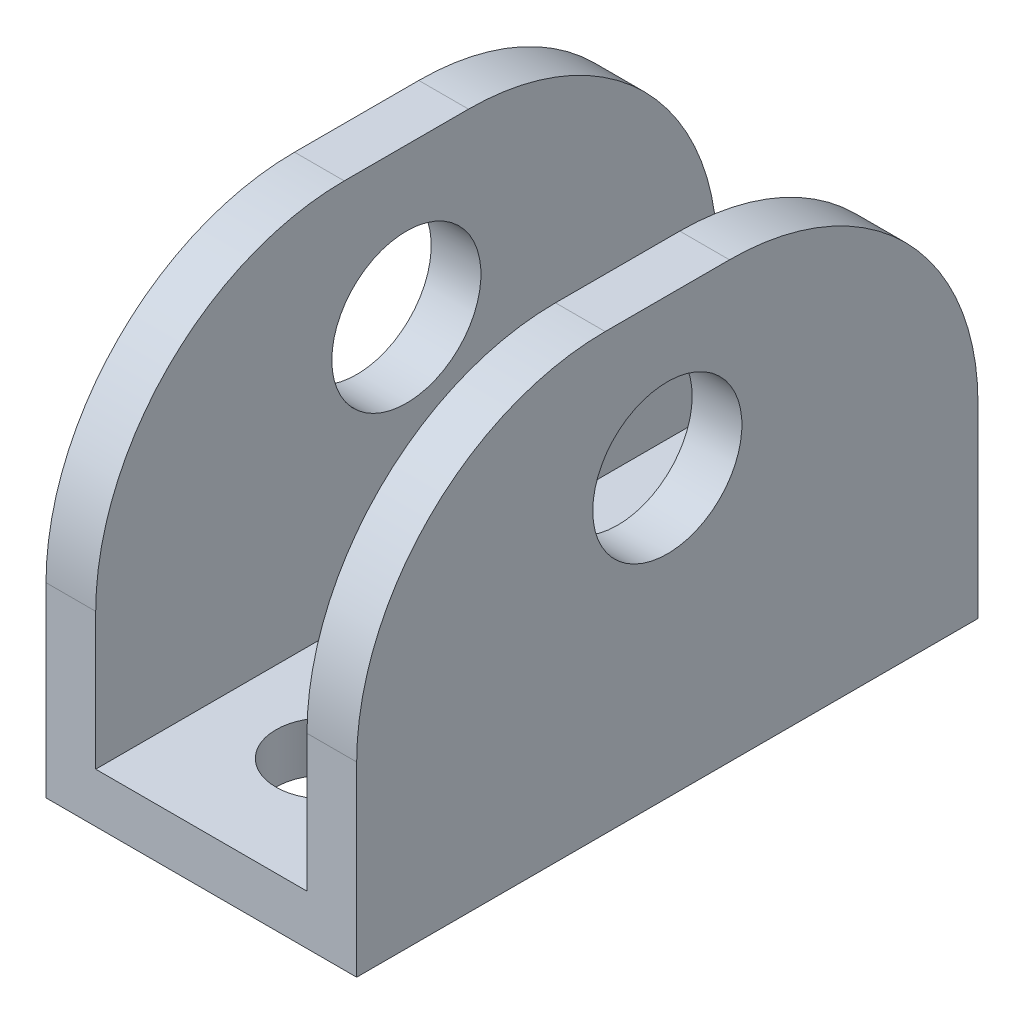
ISO-10303-21;
HEADER;
FILE_DESCRIPTION(('STEP AP214'),'2;1');
FILE_NAME('part.step','',(''),(''),'','','');
FILE_SCHEMA(('AUTOMOTIVE_DESIGN { 1 0 10303 214 1 1 1 1 }'));
ENDSEC;
DATA;
#1=APPLICATION_CONTEXT('core data for automotive mechanical design processes');
#2=APPLICATION_PROTOCOL_DEFINITION('international standard','automotive_design',2000,#1);
#3=PRODUCT_CONTEXT('',#1,'mechanical');
#4=PRODUCT('Part','Part','',(#3));
#5=PRODUCT_RELATED_PRODUCT_CATEGORY('part','',(#4));
#6=PRODUCT_DEFINITION_FORMATION('','',#4);
#7=PRODUCT_DEFINITION_CONTEXT('part definition',#1,'design');
#8=PRODUCT_DEFINITION('design','',#6,#7);
#9=PRODUCT_DEFINITION_SHAPE('','',#8);
#10=(LENGTH_UNIT() NAMED_UNIT(*) SI_UNIT(.MILLI.,.METRE.));
#11=(NAMED_UNIT(*) PLANE_ANGLE_UNIT() SI_UNIT($,.RADIAN.));
#12=(NAMED_UNIT(*) SI_UNIT($,.STERADIAN.) SOLID_ANGLE_UNIT());
#13=UNCERTAINTY_MEASURE_WITH_UNIT(LENGTH_MEASURE(1.E-05),#10,'distance_accuracy_value','');
#14=(GEOMETRIC_REPRESENTATION_CONTEXT(3) GLOBAL_UNCERTAINTY_ASSIGNED_CONTEXT((#13)) GLOBAL_UNIT_ASSIGNED_CONTEXT((#10,
#11,#12)) REPRESENTATION_CONTEXT('',''));
#15=CARTESIAN_POINT('',(0.,0.,0.));
#16=DIRECTION('',(0.,0.,1.));
#17=DIRECTION('',(1.,0.,0.));
#18=AXIS2_PLACEMENT_3D('',#15,#16,#17);
#19=CARTESIAN_POINT('',(25.,17.5,25.));
#20=DIRECTION('',(0.,-1.,0.));
#21=DIRECTION('',(0.,0.,-1.));
#22=AXIS2_PLACEMENT_3D('',#19,#20,#21);
#23=PLANE('',#22);
#24=DIRECTION('',(0.,0.,1.));
#25=VECTOR('',#24,1.);
#26=CARTESIAN_POINT('',(0.,17.5,25.));
#27=LINE('',#26,#25);
#28=CARTESIAN_POINT('',(0.,17.5,-5.));
#29=VERTEX_POINT('',#28);
#30=CARTESIAN_POINT('',(0.,17.5,5.));
#31=VERTEX_POINT('',#30);
#32=EDGE_CURVE('E184',#29,#31,#27,.T.);
#33=ORIENTED_EDGE('',*,*,#32,.T.);
#34=DIRECTION('',(-1.,0.,0.));
#35=VECTOR('',#34,1.);
#36=CARTESIAN_POINT('',(25.,17.5,5.));
#37=LINE('',#36,#35);
#38=CARTESIAN_POINT('',(4.,17.5,5.));
#39=VERTEX_POINT('',#38);
#40=EDGE_CURVE('E61',#31,#39,#37,.F.);
#41=ORIENTED_EDGE('',*,*,#40,.T.);
#42=DIRECTION('',(0.,0.,1.));
#43=VECTOR('',#42,1.);
#44=CARTESIAN_POINT('',(4.,17.5,-25.));
#45=LINE('',#44,#43);
#46=CARTESIAN_POINT('',(4.,17.5,-5.));
#47=VERTEX_POINT('',#46);
#48=EDGE_CURVE('E229',#47,#39,#45,.T.);
#49=ORIENTED_EDGE('',*,*,#48,.F.);
#50=DIRECTION('',(-1.,0.,0.));
#51=VECTOR('',#50,1.);
#52=CARTESIAN_POINT('',(25.,17.5,-5.));
#53=LINE('',#52,#51);
#54=EDGE_CURVE('E224',#47,#29,#53,.T.);
#55=ORIENTED_EDGE('',*,*,#54,.T.);
#56=EDGE_LOOP('',(#33,#41,#49,#55));
#57=FACE_BOUND('',#56,.T.);
#58=ADVANCED_FACE('F46',(#57),#23,.F.);
#59=CARTESIAN_POINT('',(25.,17.5,-25.));
#60=DIRECTION('',(0.,0.,1.));
#61=DIRECTION('',(0.,-1.,0.));
#62=AXIS2_PLACEMENT_3D('',#59,#60,#61);
#63=PLANE('',#62);
#64=DIRECTION('',(0.,1.,0.));
#65=VECTOR('',#64,1.);
#66=CARTESIAN_POINT('',(21.,-70.3109837060436,-25.));
#67=LINE('',#66,#65);
#68=CARTESIAN_POINT('',(21.,-13.5,-25.));
#69=VERTEX_POINT('',#68);
#70=CARTESIAN_POINT('',(21.,-2.49999999999999,-25.));
#71=VERTEX_POINT('',#70);
#72=EDGE_CURVE('E142',#69,#71,#67,.T.);
#73=ORIENTED_EDGE('',*,*,#72,.T.);
#74=DIRECTION('',(-1.,0.,0.));
#75=VECTOR('',#74,1.);
#76=CARTESIAN_POINT('',(25.,-2.5,-25.));
#77=LINE('',#76,#75);
#78=CARTESIAN_POINT('',(25.,-2.5,-25.));
#79=VERTEX_POINT('',#78);
#80=EDGE_CURVE('E210',#71,#79,#77,.F.);
#81=ORIENTED_EDGE('',*,*,#80,.T.);
#82=DIRECTION('',(0.,1.,0.));
#83=VECTOR('',#82,1.);
#84=CARTESIAN_POINT('',(25.,17.5,-25.));
#85=LINE('',#84,#83);
#86=CARTESIAN_POINT('',(25.,-17.5,-25.));
#87=VERTEX_POINT('',#86);
#88=EDGE_CURVE('E170',#87,#79,#85,.T.);
#89=ORIENTED_EDGE('',*,*,#88,.F.);
#90=DIRECTION('',(-1.,0.,0.));
#91=VECTOR('',#90,1.);
#92=CARTESIAN_POINT('',(25.,-17.5,-25.));
#93=LINE('',#92,#91);
#94=CARTESIAN_POINT('',(0.,-17.5,-25.));
#95=VERTEX_POINT('',#94);
#96=EDGE_CURVE('E181',#87,#95,#93,.T.);
#97=ORIENTED_EDGE('',*,*,#96,.T.);
#98=DIRECTION('',(0.,1.,0.));
#99=VECTOR('',#98,1.);
#100=CARTESIAN_POINT('',(0.,17.5,-25.));
#101=LINE('',#100,#99);
#102=CARTESIAN_POINT('',(0.,-2.5,-25.));
#103=VERTEX_POINT('',#102);
#104=EDGE_CURVE('E156',#95,#103,#101,.T.);
#105=ORIENTED_EDGE('',*,*,#104,.T.);
#106=DIRECTION('',(-1.,0.,0.));
#107=VECTOR('',#106,1.);
#108=CARTESIAN_POINT('',(25.,-2.5,-25.));
#109=LINE('',#108,#107);
#110=CARTESIAN_POINT('',(4.,-2.49999999999999,-25.));
#111=VERTEX_POINT('',#110);
#112=EDGE_CURVE('E208',#103,#111,#109,.F.);
#113=ORIENTED_EDGE('',*,*,#112,.T.);
#114=DIRECTION('',(0.,1.,0.));
#115=VECTOR('',#114,1.);
#116=CARTESIAN_POINT('',(4.,-70.3109837060436,-25.));
#117=LINE('',#116,#115);
#118=CARTESIAN_POINT('',(4.,-13.5,-25.));
#119=VERTEX_POINT('',#118);
#120=EDGE_CURVE('E147',#119,#111,#117,.T.);
#121=ORIENTED_EDGE('',*,*,#120,.F.);
#122=DIRECTION('',(1.,0.,0.));
#123=VECTOR('',#122,1.);
#124=CARTESIAN_POINT('',(4.,-13.5,-25.));
#125=LINE('',#124,#123);
#126=EDGE_CURVE('E146',#119,#69,#125,.T.);
#127=ORIENTED_EDGE('',*,*,#126,.T.);
#128=EDGE_LOOP('',(#73,#81,#89,#97,#105,#113,#121,#127));
#129=FACE_BOUND('',#128,.T.);
#130=ADVANCED_FACE('F251',(#129),#63,.F.);
#131=DIRECTION('',(0.,0.,1.));
#132=VECTOR('',#131,1.);
#133=CARTESIAN_POINT('',(25.,17.5,25.));
#134=LINE('',#133,#132);
#135=CARTESIAN_POINT('',(25.,17.5,-5.));
#136=VERTEX_POINT('',#135);
#137=CARTESIAN_POINT('',(25.,17.5,5.));
#138=VERTEX_POINT('',#137);
#139=EDGE_CURVE('E173',#136,#138,#134,.T.);
#140=ORIENTED_EDGE('',*,*,#139,.F.);
#141=DIRECTION('',(-1.,0.,0.));
#142=VECTOR('',#141,1.);
#143=CARTESIAN_POINT('',(25.,17.5,-5.));
#144=LINE('',#143,#142);
#145=CARTESIAN_POINT('',(21.,17.5,-5.));
#146=VERTEX_POINT('',#145);
#147=EDGE_CURVE('E201',#136,#146,#144,.T.);
#148=ORIENTED_EDGE('',*,*,#147,.T.);
#149=DIRECTION('',(0.,0.,-1.));
#150=VECTOR('',#149,1.);
#151=CARTESIAN_POINT('',(21.,17.5,-25.));
#152=LINE('',#151,#150);
#153=CARTESIAN_POINT('',(21.,17.5,5.));
#154=VERTEX_POINT('',#153);
#155=EDGE_CURVE('E166',#154,#146,#152,.T.);
#156=ORIENTED_EDGE('',*,*,#155,.F.);
#157=DIRECTION('',(-1.,0.,0.));
#158=VECTOR('',#157,1.);
#159=CARTESIAN_POINT('',(25.,17.5,5.));
#160=LINE('',#159,#158);
#161=EDGE_CURVE('E194',#154,#138,#160,.F.);
#162=ORIENTED_EDGE('',*,*,#161,.T.);
#163=EDGE_LOOP('',(#140,#148,#156,#162));
#164=FACE_BOUND('',#163,.T.);
#165=ADVANCED_FACE('F265',(#164),#23,.F.);
#166=CARTESIAN_POINT('',(25.,17.5,25.));
#167=DIRECTION('',(0.,0.,-1.));
#168=DIRECTION('',(0.,1.,0.));
#169=AXIS2_PLACEMENT_3D('',#166,#167,#168);
#170=PLANE('',#169);
#171=DIRECTION('',(0.,-1.,0.));
#172=VECTOR('',#171,1.);
#173=CARTESIAN_POINT('',(25.,17.5,25.));
#174=LINE('',#173,#172);
#175=CARTESIAN_POINT('',(25.,-2.5,25.));
#176=VERTEX_POINT('',#175);
#177=CARTESIAN_POINT('',(25.,-17.5,25.));
#178=VERTEX_POINT('',#177);
#179=EDGE_CURVE('E177',#176,#178,#174,.T.);
#180=ORIENTED_EDGE('',*,*,#179,.F.);
#181=DIRECTION('',(-1.,0.,0.));
#182=VECTOR('',#181,1.);
#183=CARTESIAN_POINT('',(25.,-2.5,25.));
#184=LINE('',#183,#182);
#185=CARTESIAN_POINT('',(21.,-2.5,25.));
#186=VERTEX_POINT('',#185);
#187=EDGE_CURVE('E162',#176,#186,#184,.T.);
#188=ORIENTED_EDGE('',*,*,#187,.T.);
#189=DIRECTION('',(0.,1.,0.));
#190=VECTOR('',#189,1.);
#191=CARTESIAN_POINT('',(21.,-70.3109837060436,25.));
#192=LINE('',#191,#190);
#193=CARTESIAN_POINT('',(21.,-13.5,25.));
#194=VERTEX_POINT('',#193);
#195=EDGE_CURVE('E140',#194,#186,#192,.T.);
#196=ORIENTED_EDGE('',*,*,#195,.F.);
#197=DIRECTION('',(-1.,0.,0.));
#198=VECTOR('',#197,1.);
#199=CARTESIAN_POINT('',(4.00000000000001,-13.5,25.));
#200=LINE('',#199,#198);
#201=CARTESIAN_POINT('',(4.,-13.5,25.));
#202=VERTEX_POINT('',#201);
#203=EDGE_CURVE('E151',#194,#202,#200,.T.);
#204=ORIENTED_EDGE('',*,*,#203,.T.);
#205=DIRECTION('',(0.,1.,0.));
#206=VECTOR('',#205,1.);
#207=CARTESIAN_POINT('',(4.00000000000001,-70.3109837060436,25.));
#208=LINE('',#207,#206);
#209=CARTESIAN_POINT('',(4.00000000000001,-2.5,25.));
#210=VERTEX_POINT('',#209);
#211=EDGE_CURVE('E163',#202,#210,#208,.T.);
#212=ORIENTED_EDGE('',*,*,#211,.T.);
#213=DIRECTION('',(-1.,0.,0.));
#214=VECTOR('',#213,1.);
#215=CARTESIAN_POINT('',(25.,-2.5,25.));
#216=LINE('',#215,#214);
#217=CARTESIAN_POINT('',(0.,-2.5,25.));
#218=VERTEX_POINT('',#217);
#219=EDGE_CURVE('E216',#210,#218,#216,.T.);
#220=ORIENTED_EDGE('',*,*,#219,.T.);
#221=DIRECTION('',(0.,-1.,0.));
#222=VECTOR('',#221,1.);
#223=CARTESIAN_POINT('',(0.,17.5,25.));
#224=LINE('',#223,#222);
#225=CARTESIAN_POINT('',(0.,-17.5,25.));
#226=VERTEX_POINT('',#225);
#227=EDGE_CURVE('E186',#218,#226,#224,.T.);
#228=ORIENTED_EDGE('',*,*,#227,.T.);
#229=DIRECTION('',(-1.,0.,0.));
#230=VECTOR('',#229,1.);
#231=CARTESIAN_POINT('',(25.,-17.5,25.));
#232=LINE('',#231,#230);
#233=EDGE_CURVE('E191',#178,#226,#232,.T.);
#234=ORIENTED_EDGE('',*,*,#233,.F.);
#235=EDGE_LOOP('',(#180,#188,#196,#204,#212,#220,#228,#234));
#236=FACE_BOUND('',#235,.T.);
#237=ADVANCED_FACE('F160',(#236),#170,.F.);
#238=CARTESIAN_POINT('',(25.,-17.5,25.));
#239=DIRECTION('',(0.,1.,0.));
#240=DIRECTION('',(0.,0.,1.));
#241=AXIS2_PLACEMENT_3D('',#238,#239,#240);
#242=PLANE('',#241);
#243=CARTESIAN_POINT('',(12.5,-17.5,-15.));
#244=DIRECTION('',(0.,-1.,0.));
#245=DIRECTION('',(0.,0.,-1.));
#246=AXIS2_PLACEMENT_3D('',#243,#244,#245);
#247=CIRCLE('',#246,4.);
#248=CARTESIAN_POINT('',(12.5,-17.5,-19.));
#249=VERTEX_POINT('',#248);
#250=EDGE_CURVE('E286',#249,#249,#247,.T.);
#251=ORIENTED_EDGE('',*,*,#250,.F.);
#252=EDGE_LOOP('',(#251));
#253=FACE_BOUND('',#252,.T.);
#254=CARTESIAN_POINT('',(12.5,-17.5,15.));
#255=DIRECTION('',(0.,-1.,0.));
#256=DIRECTION('',(0.,0.,-1.));
#257=AXIS2_PLACEMENT_3D('',#254,#255,#256);
#258=CIRCLE('',#257,4.);
#259=CARTESIAN_POINT('',(12.5,-17.5,11.));
#260=VERTEX_POINT('',#259);
#261=EDGE_CURVE('E280',#260,#260,#258,.T.);
#262=ORIENTED_EDGE('',*,*,#261,.F.);
#263=EDGE_LOOP('',(#262));
#264=FACE_BOUND('',#263,.T.);
#265=DIRECTION('',(0.,0.,-1.));
#266=VECTOR('',#265,1.);
#267=CARTESIAN_POINT('',(0.,-17.5,25.));
#268=LINE('',#267,#266);
#269=EDGE_CURVE('E174',#226,#95,#268,.T.);
#270=ORIENTED_EDGE('',*,*,#269,.T.);
#271=ORIENTED_EDGE('',*,*,#96,.F.);
#272=DIRECTION('',(0.,0.,-1.));
#273=VECTOR('',#272,1.);
#274=CARTESIAN_POINT('',(25.,-17.5,25.));
#275=LINE('',#274,#273);
#276=EDGE_CURVE('E179',#178,#87,#275,.T.);
#277=ORIENTED_EDGE('',*,*,#276,.F.);
#278=ORIENTED_EDGE('',*,*,#233,.T.);
#279=EDGE_LOOP('',(#270,#271,#277,#278));
#280=FACE_BOUND('',#279,.T.);
#281=ADVANCED_FACE('F255',(#253,#264,#280),#242,.F.);
#282=CARTESIAN_POINT('',(25.,0.,0.));
#283=DIRECTION('',(1.,0.,0.));
#284=DIRECTION('',(0.,0.,-1.));
#285=AXIS2_PLACEMENT_3D('',#282,#283,#284);
#286=PLANE('',#285);
#287=CARTESIAN_POINT('',(25.,5.5,0.));
#288=DIRECTION('',(-1.,0.,0.));
#289=DIRECTION('',(0.,0.,1.));
#290=AXIS2_PLACEMENT_3D('',#287,#288,#289);
#291=CIRCLE('',#290,6.);
#292=CARTESIAN_POINT('',(25.,5.5,6.));
#293=VERTEX_POINT('',#292);
#294=EDGE_CURVE('E199',#293,#293,#291,.T.);
#295=ORIENTED_EDGE('',*,*,#294,.T.);
#296=EDGE_LOOP('',(#295));
#297=FACE_BOUND('',#296,.T.);
#298=ORIENTED_EDGE('',*,*,#88,.T.);
#299=CARTESIAN_POINT('',(25.,-2.5,-5.));
#300=DIRECTION('',(1.,0.,0.));
#301=DIRECTION('',(0.,0.,-1.));
#302=AXIS2_PLACEMENT_3D('',#299,#300,#301);
#303=CIRCLE('',#302,20.);
#304=EDGE_CURVE('E214',#79,#136,#303,.T.);
#305=ORIENTED_EDGE('',*,*,#304,.T.);
#306=ORIENTED_EDGE('',*,*,#139,.T.);
#307=CARTESIAN_POINT('',(25.,-2.5,5.));
#308=DIRECTION('',(1.,0.,0.));
#309=DIRECTION('',(0.,0.,-1.));
#310=AXIS2_PLACEMENT_3D('',#307,#308,#309);
#311=CIRCLE('',#310,20.);
#312=EDGE_CURVE('E212',#138,#176,#311,.T.);
#313=ORIENTED_EDGE('',*,*,#312,.T.);
#314=ORIENTED_EDGE('',*,*,#179,.T.);
#315=ORIENTED_EDGE('',*,*,#276,.T.);
#316=EDGE_LOOP('',(#298,#305,#306,#313,#314,#315));
#317=FACE_BOUND('',#316,.T.);
#318=ADVANCED_FACE('F295',(#297,#317),#286,.T.);
#319=CARTESIAN_POINT('',(0.,0.,0.));
#320=DIRECTION('',(1.,0.,0.));
#321=DIRECTION('',(0.,0.,-1.));
#322=AXIS2_PLACEMENT_3D('',#319,#320,#321);
#323=PLANE('',#322);
#324=CARTESIAN_POINT('',(0.,5.5,0.));
#325=DIRECTION('',(-1.,0.,0.));
#326=DIRECTION('',(0.,0.,1.));
#327=AXIS2_PLACEMENT_3D('',#324,#325,#326);
#328=CIRCLE('',#327,6.);
#329=CARTESIAN_POINT('',(0.,5.5,6.));
#330=VERTEX_POINT('',#329);
#331=EDGE_CURVE('E272',#330,#330,#328,.T.);
#332=ORIENTED_EDGE('',*,*,#331,.F.);
#333=EDGE_LOOP('',(#332));
#334=FACE_BOUND('',#333,.T.);
#335=ORIENTED_EDGE('',*,*,#227,.F.);
#336=CARTESIAN_POINT('',(0.,-2.5,5.));
#337=DIRECTION('',(1.,0.,0.));
#338=DIRECTION('',(0.,0.,-1.));
#339=AXIS2_PLACEMENT_3D('',#336,#337,#338);
#340=CIRCLE('',#339,20.);
#341=EDGE_CURVE('E222',#218,#31,#340,.F.);
#342=ORIENTED_EDGE('',*,*,#341,.T.);
#343=ORIENTED_EDGE('',*,*,#32,.F.);
#344=CARTESIAN_POINT('',(0.,-2.5,-5.));
#345=DIRECTION('',(1.,0.,0.));
#346=DIRECTION('',(0.,0.,-1.));
#347=AXIS2_PLACEMENT_3D('',#344,#345,#346);
#348=CIRCLE('',#347,20.);
#349=EDGE_CURVE('E220',#29,#103,#348,.F.);
#350=ORIENTED_EDGE('',*,*,#349,.T.);
#351=ORIENTED_EDGE('',*,*,#104,.F.);
#352=ORIENTED_EDGE('',*,*,#269,.F.);
#353=EDGE_LOOP('',(#335,#342,#343,#350,#351,#352));
#354=FACE_BOUND('',#353,.T.);
#355=ADVANCED_FACE('F233',(#334,#354),#323,.F.);
#356=CARTESIAN_POINT('',(4.,-70.3109837060436,-25.));
#357=DIRECTION('',(-1.,0.,0.));
#358=DIRECTION('',(0.,0.,1.));
#359=AXIS2_PLACEMENT_3D('',#356,#357,#358);
#360=PLANE('',#359);
#361=CARTESIAN_POINT('',(4.,5.5,0.));
#362=DIRECTION('',(-1.,0.,0.));
#363=DIRECTION('',(0.,0.,1.));
#364=AXIS2_PLACEMENT_3D('',#361,#362,#363);
#365=CIRCLE('',#364,6.);
#366=CARTESIAN_POINT('',(4.,5.5,6.));
#367=VERTEX_POINT('',#366);
#368=EDGE_CURVE('E198',#367,#367,#365,.T.);
#369=ORIENTED_EDGE('',*,*,#368,.T.);
#370=EDGE_LOOP('',(#369));
#371=FACE_BOUND('',#370,.T.);
#372=ORIENTED_EDGE('',*,*,#48,.T.);
#373=CARTESIAN_POINT('',(4.,-2.5,5.));
#374=DIRECTION('',(-1.,0.,0.));
#375=DIRECTION('',(0.,0.,1.));
#376=AXIS2_PLACEMENT_3D('',#373,#374,#375);
#377=CIRCLE('',#376,20.);
#378=EDGE_CURVE('E14',#39,#210,#377,.F.);
#379=ORIENTED_EDGE('',*,*,#378,.T.);
#380=ORIENTED_EDGE('',*,*,#211,.F.);
#381=DIRECTION('',(0.,0.,-1.));
#382=VECTOR('',#381,1.);
#383=CARTESIAN_POINT('',(4.,-13.5,-25.));
#384=LINE('',#383,#382);
#385=EDGE_CURVE('E153',#202,#119,#384,.T.);
#386=ORIENTED_EDGE('',*,*,#385,.T.);
#387=ORIENTED_EDGE('',*,*,#120,.T.);
#388=CARTESIAN_POINT('',(4.,-2.5,-5.));
#389=DIRECTION('',(-1.,0.,0.));
#390=DIRECTION('',(0.,0.,1.));
#391=AXIS2_PLACEMENT_3D('',#388,#389,#390);
#392=CIRCLE('',#391,20.);
#393=EDGE_CURVE('E54',#111,#47,#392,.F.);
#394=ORIENTED_EDGE('',*,*,#393,.T.);
#395=EDGE_LOOP('',(#372,#379,#380,#386,#387,#394));
#396=FACE_BOUND('',#395,.T.);
#397=ADVANCED_FACE('F241',(#371,#396),#360,.F.);
#398=CARTESIAN_POINT('',(21.,-70.3109837060436,-25.));
#399=DIRECTION('',(1.,0.,0.));
#400=DIRECTION('',(0.,0.,-1.));
#401=AXIS2_PLACEMENT_3D('',#398,#399,#400);
#402=PLANE('',#401);
#403=CARTESIAN_POINT('',(21.,5.5,0.));
#404=DIRECTION('',(1.,0.,0.));
#405=DIRECTION('',(0.,0.,-1.));
#406=AXIS2_PLACEMENT_3D('',#403,#404,#405);
#407=CIRCLE('',#406,6.);
#408=CARTESIAN_POINT('',(21.,5.5,-6.));
#409=VERTEX_POINT('',#408);
#410=EDGE_CURVE('E195',#409,#409,#407,.T.);
#411=ORIENTED_EDGE('',*,*,#410,.T.);
#412=EDGE_LOOP('',(#411));
#413=FACE_BOUND('',#412,.T.);
#414=ORIENTED_EDGE('',*,*,#155,.T.);
#415=CARTESIAN_POINT('',(21.,-2.5,-5.));
#416=DIRECTION('',(1.,0.,0.));
#417=DIRECTION('',(0.,0.,-1.));
#418=AXIS2_PLACEMENT_3D('',#415,#416,#417);
#419=CIRCLE('',#418,20.);
#420=EDGE_CURVE('E206',#146,#71,#419,.F.);
#421=ORIENTED_EDGE('',*,*,#420,.T.);
#422=ORIENTED_EDGE('',*,*,#72,.F.);
#423=DIRECTION('',(0.,0.,1.));
#424=VECTOR('',#423,1.);
#425=CARTESIAN_POINT('',(21.,-13.5,-25.));
#426=LINE('',#425,#424);
#427=EDGE_CURVE('E135',#69,#194,#426,.T.);
#428=ORIENTED_EDGE('',*,*,#427,.T.);
#429=ORIENTED_EDGE('',*,*,#195,.T.);
#430=CARTESIAN_POINT('',(21.,-2.5,5.));
#431=DIRECTION('',(1.,0.,0.));
#432=DIRECTION('',(0.,0.,-1.));
#433=AXIS2_PLACEMENT_3D('',#430,#431,#432);
#434=CIRCLE('',#433,20.);
#435=EDGE_CURVE('E204',#186,#154,#434,.F.);
#436=ORIENTED_EDGE('',*,*,#435,.T.);
#437=EDGE_LOOP('',(#414,#421,#422,#428,#429,#436));
#438=FACE_BOUND('',#437,.T.);
#439=ADVANCED_FACE('F138',(#413,#438),#402,.F.);
#440=CARTESIAN_POINT('',(25.,-13.5,25.));
#441=DIRECTION('',(0.,1.,0.));
#442=DIRECTION('',(0.,0.,1.));
#443=AXIS2_PLACEMENT_3D('',#440,#441,#442);
#444=PLANE('',#443);
#445=CARTESIAN_POINT('',(12.5,-13.5,-15.));
#446=DIRECTION('',(0.,1.,0.));
#447=DIRECTION('',(0.,0.,1.));
#448=AXIS2_PLACEMENT_3D('',#445,#446,#447);
#449=CIRCLE('',#448,4.);
#450=CARTESIAN_POINT('',(12.5,-13.5,-11.));
#451=VERTEX_POINT('',#450);
#452=EDGE_CURVE('E283',#451,#451,#449,.F.);
#453=ORIENTED_EDGE('',*,*,#452,.T.);
#454=EDGE_LOOP('',(#453));
#455=FACE_BOUND('',#454,.T.);
#456=CARTESIAN_POINT('',(12.5,-13.5,15.));
#457=DIRECTION('',(0.,1.,0.));
#458=DIRECTION('',(0.,0.,1.));
#459=AXIS2_PLACEMENT_3D('',#456,#457,#458);
#460=CIRCLE('',#459,4.);
#461=CARTESIAN_POINT('',(12.5,-13.5,19.));
#462=VERTEX_POINT('',#461);
#463=EDGE_CURVE('E275',#462,#462,#460,.F.);
#464=ORIENTED_EDGE('',*,*,#463,.T.);
#465=EDGE_LOOP('',(#464));
#466=FACE_BOUND('',#465,.T.);
#467=ORIENTED_EDGE('',*,*,#385,.F.);
#468=ORIENTED_EDGE('',*,*,#203,.F.);
#469=ORIENTED_EDGE('',*,*,#427,.F.);
#470=ORIENTED_EDGE('',*,*,#126,.F.);
#471=EDGE_LOOP('',(#467,#468,#469,#470));
#472=FACE_BOUND('',#471,.T.);
#473=ADVANCED_FACE('F152',(#455,#466,#472),#444,.T.);
#474=CARTESIAN_POINT('',(25.,5.5,0.));
#475=DIRECTION('',(-1.,0.,0.));
#476=DIRECTION('',(0.,0.,1.));
#477=AXIS2_PLACEMENT_3D('',#474,#475,#476);
#478=CYLINDRICAL_SURFACE('',#477,6.);
#479=ORIENTED_EDGE('',*,*,#294,.F.);
#480=EDGE_LOOP('',(#479));
#481=FACE_BOUND('',#480,.T.);
#482=ORIENTED_EDGE('',*,*,#410,.F.);
#483=EDGE_LOOP('',(#482));
#484=FACE_BOUND('',#483,.T.);
#485=ADVANCED_FACE('F307',(#481,#484),#478,.F.);
#486=ORIENTED_EDGE('',*,*,#331,.T.);
#487=EDGE_LOOP('',(#486));
#488=FACE_BOUND('',#487,.T.);
#489=ORIENTED_EDGE('',*,*,#368,.F.);
#490=EDGE_LOOP('',(#489));
#491=FACE_BOUND('',#490,.T.);
#492=ADVANCED_FACE('F302',(#488,#491),#478,.F.);
#493=CARTESIAN_POINT('',(12.5,-2.18629150101524,15.));
#494=DIRECTION('',(0.,-1.,0.));
#495=DIRECTION('',(0.,0.,-1.));
#496=AXIS2_PLACEMENT_3D('',#493,#494,#495);
#497=CYLINDRICAL_SURFACE('',#496,4.);
#498=ORIENTED_EDGE('',*,*,#261,.T.);
#499=EDGE_LOOP('',(#498));
#500=FACE_BOUND('',#499,.T.);
#501=ORIENTED_EDGE('',*,*,#463,.F.);
#502=EDGE_LOOP('',(#501));
#503=FACE_BOUND('',#502,.T.);
#504=ADVANCED_FACE('F299',(#500,#503),#497,.F.);
#505=CARTESIAN_POINT('',(12.5,-2.18629150101524,-15.));
#506=DIRECTION('',(0.,-1.,0.));
#507=DIRECTION('',(0.,0.,-1.));
#508=AXIS2_PLACEMENT_3D('',#505,#506,#507);
#509=CYLINDRICAL_SURFACE('',#508,4.);
#510=ORIENTED_EDGE('',*,*,#250,.T.);
#511=EDGE_LOOP('',(#510));
#512=FACE_BOUND('',#511,.T.);
#513=ORIENTED_EDGE('',*,*,#452,.F.);
#514=EDGE_LOOP('',(#513));
#515=FACE_BOUND('',#514,.T.);
#516=ADVANCED_FACE('F290',(#512,#515),#509,.F.);
#517=CARTESIAN_POINT('',(25.,-2.5,-5.));
#518=DIRECTION('',(-1.,0.,0.));
#519=DIRECTION('',(0.,0.,1.));
#520=AXIS2_PLACEMENT_3D('',#517,#518,#519);
#521=CYLINDRICAL_SURFACE('',#520,20.);
#522=ORIENTED_EDGE('',*,*,#304,.F.);
#523=ORIENTED_EDGE('',*,*,#80,.F.);
#524=ORIENTED_EDGE('',*,*,#420,.F.);
#525=ORIENTED_EDGE('',*,*,#147,.F.);
#526=EDGE_LOOP('',(#522,#523,#524,#525));
#527=FACE_BOUND('',#526,.T.);
#528=ADVANCED_FACE('F269',(#527),#521,.T.);
#529=CARTESIAN_POINT('',(25.,-2.5,5.));
#530=DIRECTION('',(-1.,0.,0.));
#531=DIRECTION('',(0.,0.,1.));
#532=AXIS2_PLACEMENT_3D('',#529,#530,#531);
#533=CYLINDRICAL_SURFACE('',#532,20.);
#534=ORIENTED_EDGE('',*,*,#312,.F.);
#535=ORIENTED_EDGE('',*,*,#161,.F.);
#536=ORIENTED_EDGE('',*,*,#435,.F.);
#537=ORIENTED_EDGE('',*,*,#187,.F.);
#538=EDGE_LOOP('',(#534,#535,#536,#537));
#539=FACE_BOUND('',#538,.T.);
#540=ADVANCED_FACE('F260',(#539),#533,.T.);
#541=CARTESIAN_POINT('',(25.,-2.5,5.));
#542=DIRECTION('',(-1.,0.,0.));
#543=DIRECTION('',(0.,0.,1.));
#544=AXIS2_PLACEMENT_3D('',#541,#542,#543);
#545=CYLINDRICAL_SURFACE('',#544,20.);
#546=ORIENTED_EDGE('',*,*,#378,.F.);
#547=ORIENTED_EDGE('',*,*,#40,.F.);
#548=ORIENTED_EDGE('',*,*,#341,.F.);
#549=ORIENTED_EDGE('',*,*,#219,.F.);
#550=EDGE_LOOP('',(#546,#547,#548,#549));
#551=FACE_BOUND('',#550,.T.);
#552=ADVANCED_FACE('F239',(#551),#545,.T.);
#553=CARTESIAN_POINT('',(25.,-2.5,-5.));
#554=DIRECTION('',(-1.,0.,0.));
#555=DIRECTION('',(0.,0.,1.));
#556=AXIS2_PLACEMENT_3D('',#553,#554,#555);
#557=CYLINDRICAL_SURFACE('',#556,20.);
#558=ORIENTED_EDGE('',*,*,#393,.F.);
#559=ORIENTED_EDGE('',*,*,#112,.F.);
#560=ORIENTED_EDGE('',*,*,#349,.F.);
#561=ORIENTED_EDGE('',*,*,#54,.F.);
#562=EDGE_LOOP('',(#558,#559,#560,#561));
#563=FACE_BOUND('',#562,.T.);
#564=ADVANCED_FACE('F48',(#563),#557,.T.);
#565=CLOSED_SHELL('',(#58,#130,#165,#237,#281,#318,#355,#397,#439,#473,#485,#492,#504,#516,#528,
#540,#552,#564));
#566=MANIFOLD_SOLID_BREP('B2',#565);
#567=ADVANCED_BREP_SHAPE_REPRESENTATION('',(#18,#566),#14);
#568=SHAPE_DEFINITION_REPRESENTATION(#9,#567);
ENDSEC;
END-ISO-10303-21;
